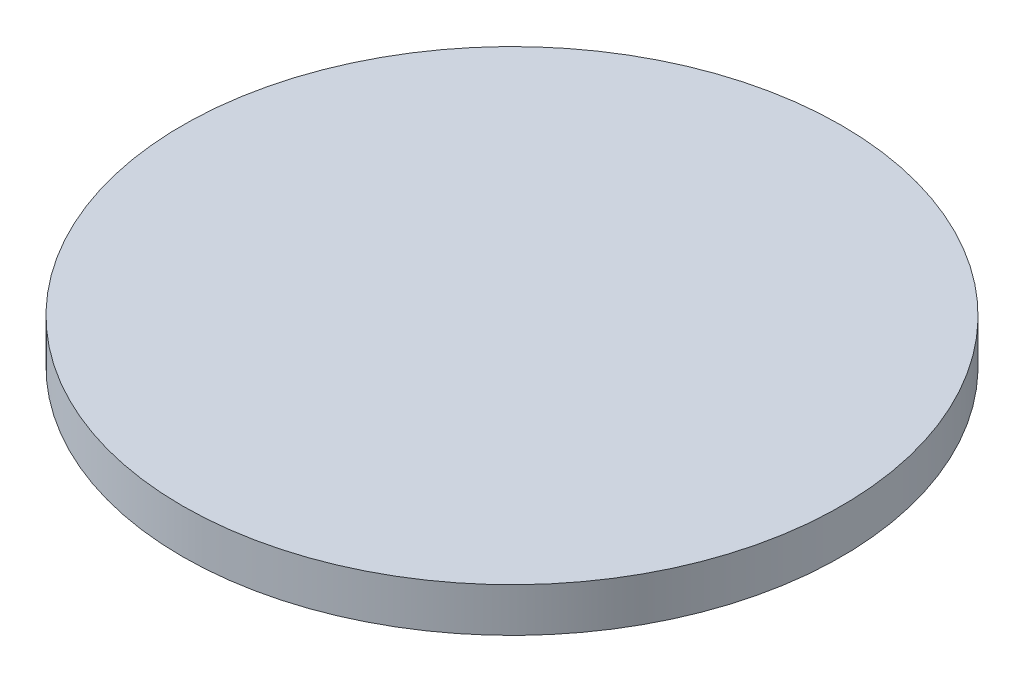
ISO-10303-21;
HEADER;
FILE_DESCRIPTION(('STEP AP214'),'2;1');
FILE_NAME('part.step','',(''),(''),'','','');
FILE_SCHEMA(('AUTOMOTIVE_DESIGN { 1 0 10303 214 1 1 1 1 }'));
ENDSEC;
DATA;
#1=APPLICATION_CONTEXT('core data for automotive mechanical design processes');
#2=APPLICATION_PROTOCOL_DEFINITION('international standard','automotive_design',2000,#1);
#3=PRODUCT_CONTEXT('',#1,'mechanical');
#4=PRODUCT('Part','Part','',(#3));
#5=PRODUCT_RELATED_PRODUCT_CATEGORY('part','',(#4));
#6=PRODUCT_DEFINITION_FORMATION('','',#4);
#7=PRODUCT_DEFINITION_CONTEXT('part definition',#1,'design');
#8=PRODUCT_DEFINITION('design','',#6,#7);
#9=PRODUCT_DEFINITION_SHAPE('','',#8);
#10=(LENGTH_UNIT() NAMED_UNIT(*) SI_UNIT(.MILLI.,.METRE.));
#11=(NAMED_UNIT(*) PLANE_ANGLE_UNIT() SI_UNIT($,.RADIAN.));
#12=(NAMED_UNIT(*) SI_UNIT($,.STERADIAN.) SOLID_ANGLE_UNIT());
#13=UNCERTAINTY_MEASURE_WITH_UNIT(LENGTH_MEASURE(1.E-05),#10,'distance_accuracy_value','');
#14=(GEOMETRIC_REPRESENTATION_CONTEXT(3) GLOBAL_UNCERTAINTY_ASSIGNED_CONTEXT((#13)) GLOBAL_UNIT_ASSIGNED_CONTEXT((#10,
#11,#12)) REPRESENTATION_CONTEXT('',''));
#15=CARTESIAN_POINT('',(0.,0.,0.));
#16=DIRECTION('',(0.,0.,1.));
#17=DIRECTION('',(1.,0.,0.));
#18=AXIS2_PLACEMENT_3D('',#15,#16,#17);
#19=CARTESIAN_POINT('',(0.,2.,0.));
#20=DIRECTION('',(0.,-1.,0.));
#21=DIRECTION('',(0.,0.,-1.));
#22=AXIS2_PLACEMENT_3D('',#19,#20,#21);
#23=CYLINDRICAL_SURFACE('',#22,15.);
#24=CARTESIAN_POINT('',(0.,2.,0.));
#25=DIRECTION('',(0.,1.,0.));
#26=DIRECTION('',(0.,0.,1.));
#27=AXIS2_PLACEMENT_3D('',#24,#25,#26);
#28=CIRCLE('',#27,15.);
#29=CARTESIAN_POINT('',(0.,2.,15.));
#30=VERTEX_POINT('',#29);
#31=EDGE_CURVE('E10',#30,#30,#28,.T.);
#32=ORIENTED_EDGE('',*,*,#31,.F.);
#33=EDGE_LOOP('',(#32));
#34=FACE_BOUND('',#33,.T.);
#35=CARTESIAN_POINT('',(0.,0.,0.));
#36=DIRECTION('',(0.,1.,0.));
#37=DIRECTION('',(0.,0.,1.));
#38=AXIS2_PLACEMENT_3D('',#35,#36,#37);
#39=CIRCLE('',#38,15.);
#40=CARTESIAN_POINT('',(0.,0.,15.));
#41=VERTEX_POINT('',#40);
#42=EDGE_CURVE('E34',#41,#41,#39,.T.);
#43=ORIENTED_EDGE('',*,*,#42,.T.);
#44=EDGE_LOOP('',(#43));
#45=FACE_BOUND('',#44,.T.);
#46=ADVANCED_FACE('F31',(#34,#45),#23,.T.);
#47=CARTESIAN_POINT('',(0.,2.,0.));
#48=DIRECTION('',(0.,1.,0.));
#49=DIRECTION('',(0.,0.,1.));
#50=AXIS2_PLACEMENT_3D('',#47,#48,#49);
#51=PLANE('',#50);
#52=ORIENTED_EDGE('',*,*,#31,.T.);
#53=EDGE_LOOP('',(#52));
#54=FACE_BOUND('',#53,.T.);
#55=ADVANCED_FACE('F46',(#54),#51,.T.);
#56=CARTESIAN_POINT('',(0.,0.,0.));
#57=DIRECTION('',(0.,1.,0.));
#58=DIRECTION('',(0.,0.,1.));
#59=AXIS2_PLACEMENT_3D('',#56,#57,#58);
#60=PLANE('',#59);
#61=ORIENTED_EDGE('',*,*,#42,.F.);
#62=EDGE_LOOP('',(#61));
#63=FACE_BOUND('',#62,.T.);
#64=ADVANCED_FACE('F44',(#63),#60,.F.);
#65=CLOSED_SHELL('',(#46,#55,#64));
#66=MANIFOLD_SOLID_BREP('B2',#65);
#67=ADVANCED_BREP_SHAPE_REPRESENTATION('',(#18,#66),#14);
#68=SHAPE_DEFINITION_REPRESENTATION(#9,#67);
ENDSEC;
END-ISO-10303-21;
